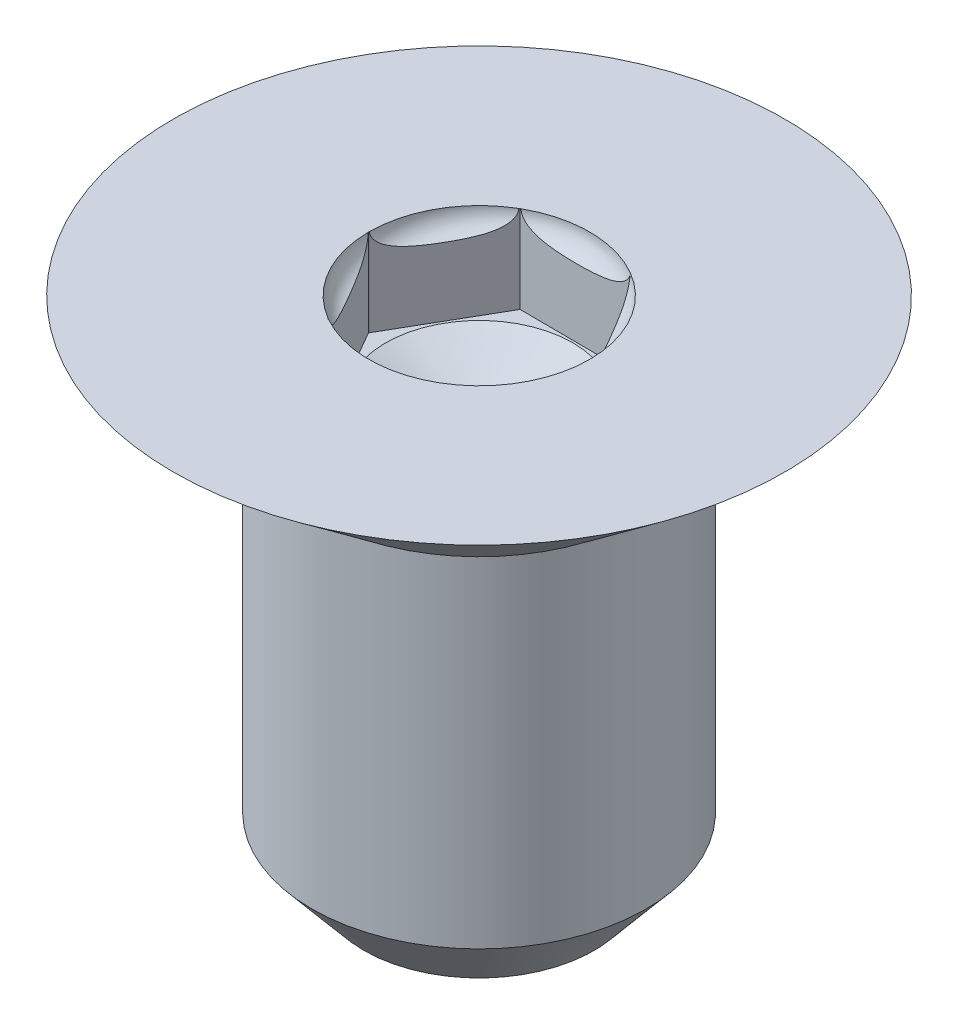
ISO-10303-21;
HEADER;
FILE_DESCRIPTION(('STEP AP214'),'2;1');
FILE_NAME('part.step','',(''),(''),'','','');
FILE_SCHEMA(('AUTOMOTIVE_DESIGN { 1 0 10303 214 1 1 1 1 }'));
ENDSEC;
DATA;
#1=APPLICATION_CONTEXT('core data for automotive mechanical design processes');
#2=APPLICATION_PROTOCOL_DEFINITION('international standard','automotive_design',2000,#1);
#3=PRODUCT_CONTEXT('',#1,'mechanical');
#4=PRODUCT('Part','Part','',(#3));
#5=PRODUCT_RELATED_PRODUCT_CATEGORY('part','',(#4));
#6=PRODUCT_DEFINITION_FORMATION('','',#4);
#7=PRODUCT_DEFINITION_CONTEXT('part definition',#1,'design');
#8=PRODUCT_DEFINITION('design','',#6,#7);
#9=PRODUCT_DEFINITION_SHAPE('','',#8);
#10=(LENGTH_UNIT() NAMED_UNIT(*) SI_UNIT(.MILLI.,.METRE.));
#11=(NAMED_UNIT(*) PLANE_ANGLE_UNIT() SI_UNIT($,.RADIAN.));
#12=(NAMED_UNIT(*) SI_UNIT($,.STERADIAN.) SOLID_ANGLE_UNIT());
#13=UNCERTAINTY_MEASURE_WITH_UNIT(LENGTH_MEASURE(1.E-05),#10,'distance_accuracy_value','');
#14=(GEOMETRIC_REPRESENTATION_CONTEXT(3) GLOBAL_UNCERTAINTY_ASSIGNED_CONTEXT((#13)) GLOBAL_UNIT_ASSIGNED_CONTEXT((#10,
#11,#12)) REPRESENTATION_CONTEXT('',''));
#15=CARTESIAN_POINT('',(0.,0.,0.));
#16=DIRECTION('',(0.,0.,1.));
#17=DIRECTION('',(1.,0.,0.));
#18=AXIS2_PLACEMENT_3D('',#15,#16,#17);
#19=CARTESIAN_POINT('',(-7.85165602355629,18.8976167193551,-0.00419462145266587));
#20=DIRECTION('',(0.,-1.,0.));
#21=DIRECTION('',(0.,0.,-1.));
#22=AXIS2_PLACEMENT_3D('',#19,#20,#21);
#23=PLANE('',#22);
#24=CARTESIAN_POINT('',(-9.23016287600338,18.8976167193551,0.));
#25=DIRECTION('',(0.,-1.,0.));
#26=DIRECTION('',(0.,0.,-1.));
#27=AXIS2_PLACEMENT_3D('',#24,#25,#26);
#28=CIRCLE('',#27,1.16684271429529);
#29=CARTESIAN_POINT('',(-9.23016287600338,18.8976167193551,-1.16684271429529));
#30=VERTEX_POINT('',#29);
#31=EDGE_CURVE('E153',#30,#30,#28,.T.);
#32=ORIENTED_EDGE('',*,*,#31,.T.);
#33=EDGE_LOOP('',(#32));
#34=FACE_BOUND('',#33,.T.);
#35=DIRECTION('',(0.5,0.,-0.866025403784439));
#36=VECTOR('',#35,1.);
#37=CARTESIAN_POINT('',(-7.85165602355629,18.8976167193551,-0.00419462145266571));
#38=LINE('',#37,#36);
#39=CARTESIAN_POINT('',(-8.5409052544111,18.8976167193551,1.18962006546564));
#40=VERTEX_POINT('',#39);
#41=CARTESIAN_POINT('',(-7.85407778938113,18.8976167193551,0.));
#42=VERTEX_POINT('',#41);
#43=EDGE_CURVE('E228',#40,#42,#38,.T.);
#44=ORIENTED_EDGE('',*,*,#43,.T.);
#45=DIRECTION('',(0.5,0.,0.866025403784439));
#46=VECTOR('',#45,1.);
#47=CARTESIAN_POINT('',(-7.85165602355629,18.8976167193551,0.00419462145266571));
#48=LINE('',#47,#46);
#49=CARTESIAN_POINT('',(-8.5409052544111,18.8976167193551,-1.18962006546564));
#50=VERTEX_POINT('',#49);
#51=EDGE_CURVE('E158',#50,#42,#48,.T.);
#52=ORIENTED_EDGE('',*,*,#51,.F.);
#53=DIRECTION('',(0.99998154623352,0.,0.00607512900423805));
#54=VECTOR('',#53,1.);
#55=CARTESIAN_POINT('',(-8.5409052544111,18.8976167193551,-1.18962006546564));
#56=LINE('',#55,#54);
#57=CARTESIAN_POINT('',(-9.91937827763201,18.8976167193551,-1.19799462145267));
#58=VERTEX_POINT('',#57);
#59=EDGE_CURVE('E239',#58,#50,#56,.T.);
#60=ORIENTED_EDGE('',*,*,#59,.F.);
#61=DIRECTION('',(0.5,0.,-0.866025403784439));
#62=VECTOR('',#61,1.);
#63=CARTESIAN_POINT('',(-9.91937827763201,18.8976167193551,-1.19799462145267));
#64=LINE('',#63,#62);
#65=CARTESIAN_POINT('',(-10.6086275084868,18.8976167193551,-0.00417993453436413));
#66=VERTEX_POINT('',#65);
#67=EDGE_CURVE('E146',#66,#58,#64,.T.);
#68=ORIENTED_EDGE('',*,*,#67,.F.);
#69=DIRECTION('',(-0.494729557067822,0.,-0.869046986855991));
#70=VECTOR('',#69,1.);
#71=CARTESIAN_POINT('',(-10.6086275084868,18.8976167193551,-0.00417993453436413));
#72=LINE('',#71,#70);
#73=CARTESIAN_POINT('',(-10.6062479626256,18.8976167193551,0.));
#74=VERTEX_POINT('',#73);
#75=EDGE_CURVE('E142',#74,#66,#72,.T.);
#76=ORIENTED_EDGE('',*,*,#75,.F.);
#77=DIRECTION('',(-0.494729557067822,0.,0.869046986855991));
#78=VECTOR('',#77,1.);
#79=CARTESIAN_POINT('',(-10.6086275084868,18.8976167193551,0.00417993453436413));
#80=LINE('',#79,#78);
#81=CARTESIAN_POINT('',(-10.6086275084868,18.8976167193551,0.00417993453436413));
#82=VERTEX_POINT('',#81);
#83=EDGE_CURVE('E199',#74,#82,#80,.T.);
#84=ORIENTED_EDGE('',*,*,#83,.T.);
#85=DIRECTION('',(0.5,0.,0.866025403784439));
#86=VECTOR('',#85,1.);
#87=CARTESIAN_POINT('',(-9.91937827763201,18.8976167193551,1.19799462145267));
#88=LINE('',#87,#86);
#89=CARTESIAN_POINT('',(-9.91937827763201,18.8976167193551,1.19799462145267));
#90=VERTEX_POINT('',#89);
#91=EDGE_CURVE('E485',#82,#90,#88,.T.);
#92=ORIENTED_EDGE('',*,*,#91,.T.);
#93=DIRECTION('',(0.99998154623352,0.,-0.00607512900423805));
#94=VECTOR('',#93,1.);
#95=CARTESIAN_POINT('',(-8.5409052544111,18.8976167193551,1.18962006546564));
#96=LINE('',#95,#94);
#97=EDGE_CURVE('E233',#90,#40,#96,.T.);
#98=ORIENTED_EDGE('',*,*,#97,.T.);
#99=EDGE_LOOP('',(#44,#52,#60,#68,#76,#84,#92,#98));
#100=FACE_BOUND('',#99,.T.);
#101=ADVANCED_FACE('F33',(#34,#100),#23,.F.);
#102=CARTESIAN_POINT('',(-9.23255929209828,13.6398167193551,0.));
#103=DIRECTION('',(0.,1.,0.));
#104=DIRECTION('',(0.,0.,1.));
#105=AXIS2_PLACEMENT_3D('',#102,#103,#104);
#106=PLANE('',#105);
#107=CARTESIAN_POINT('',(-9.23255929209828,13.6398167193551,0.));
#108=DIRECTION('',(0.,1.,0.));
#109=DIRECTION('',(0.,0.,1.));
#110=AXIS2_PLACEMENT_3D('',#107,#108,#109);
#111=CIRCLE('',#110,1.43526892958908);
#112=CARTESIAN_POINT('',(-9.23255929209828,13.6398167193551,1.43526892958908));
#113=VERTEX_POINT('',#112);
#114=EDGE_CURVE('E11',#113,#113,#111,.T.);
#115=ORIENTED_EDGE('',*,*,#114,.F.);
#116=EDGE_LOOP('',(#115));
#117=FACE_BOUND('',#116,.T.);
#118=ADVANCED_FACE('F35',(#117),#106,.F.);
#119=CARTESIAN_POINT('',(-9.23255929209828,13.6398167193551,0.));
#120=DIRECTION('',(0.,1.,0.));
#121=DIRECTION('',(0.,0.,1.));
#122=AXIS2_PLACEMENT_3D('',#119,#120,#121);
#123=CONICAL_SURFACE('',#122,1.43526892958908,0.698131700797733);
#124=CARTESIAN_POINT('',(-9.23255929209828,14.4115141988337,0.));
#125=DIRECTION('',(0.,1.,0.));
#126=DIRECTION('',(0.,0.,1.));
#127=AXIS2_PLACEMENT_3D('',#124,#125,#126);
#128=CIRCLE('',#127,2.0828);
#129=CARTESIAN_POINT('',(-9.23255929209828,14.4115141988337,2.0828));
#130=VERTEX_POINT('',#129);
#131=EDGE_CURVE('E41',#130,#130,#128,.T.);
#132=ORIENTED_EDGE('',*,*,#131,.F.);
#133=EDGE_LOOP('',(#132));
#134=FACE_BOUND('',#133,.T.);
#135=ORIENTED_EDGE('',*,*,#114,.T.);
#136=EDGE_LOOP('',(#135));
#137=FACE_BOUND('',#136,.T.);
#138=ADVANCED_FACE('F220',(#134,#137),#123,.T.);
#139=CARTESIAN_POINT('',(-9.23255929209828,19.9898167193551,0.));
#140=DIRECTION('',(0.,1.,0.));
#141=DIRECTION('',(0.,0.,1.));
#142=AXIS2_PLACEMENT_3D('',#139,#140,#141);
#143=CYLINDRICAL_SURFACE('',#142,2.0828);
#144=CARTESIAN_POINT('',(-9.23255929209828,18.6436167193551,0.));
#145=DIRECTION('',(0.,1.,0.));
#146=DIRECTION('',(0.,0.,1.));
#147=AXIS2_PLACEMENT_3D('',#144,#145,#146);
#148=CIRCLE('',#147,2.0828);
#149=CARTESIAN_POINT('',(-9.23255929209828,18.6436167193551,2.0828));
#150=VERTEX_POINT('',#149);
#151=EDGE_CURVE('E282',#150,#150,#148,.T.);
#152=ORIENTED_EDGE('',*,*,#151,.F.);
#153=EDGE_LOOP('',(#152));
#154=FACE_BOUND('',#153,.T.);
#155=ORIENTED_EDGE('',*,*,#131,.T.);
#156=EDGE_LOOP('',(#155));
#157=FACE_BOUND('',#156,.T.);
#158=ADVANCED_FACE('F287',(#154,#157),#143,.T.);
#159=CARTESIAN_POINT('',(-9.23255929209828,18.6436167193551,0.));
#160=DIRECTION('',(0.,1.,0.));
#161=DIRECTION('',(0.,0.,1.));
#162=AXIS2_PLACEMENT_3D('',#159,#160,#161);
#163=CONICAL_SURFACE('',#162,2.0828,0.908735864297173);
#164=CARTESIAN_POINT('',(-9.23255929209828,19.9898167193551,0.));
#165=DIRECTION('',(0.,1.,0.));
#166=DIRECTION('',(0.,0.,1.));
#167=AXIS2_PLACEMENT_3D('',#164,#165,#166);
#168=CIRCLE('',#167,3.81);
#169=CARTESIAN_POINT('',(-9.23255929209828,19.9898167193551,3.81));
#170=VERTEX_POINT('',#169);
#171=EDGE_CURVE('E275',#170,#170,#168,.T.);
#172=ORIENTED_EDGE('',*,*,#171,.F.);
#173=EDGE_LOOP('',(#172));
#174=FACE_BOUND('',#173,.T.);
#175=ORIENTED_EDGE('',*,*,#151,.T.);
#176=EDGE_LOOP('',(#175));
#177=FACE_BOUND('',#176,.T.);
#178=ADVANCED_FACE('F295',(#174,#177),#163,.T.);
#179=CARTESIAN_POINT('',(-9.23255929209828,19.9898167193551,0.));
#180=DIRECTION('',(0.,-1.,0.));
#181=DIRECTION('',(0.,0.,-1.));
#182=AXIS2_PLACEMENT_3D('',#179,#180,#181);
#183=PLANE('',#182);
#184=ORIENTED_EDGE('',*,*,#171,.T.);
#185=EDGE_LOOP('',(#184));
#186=FACE_BOUND('',#185,.T.);
#187=CARTESIAN_POINT('',(-9.23016287600338,19.9898167193551,0.));
#188=DIRECTION('',(0.,1.,0.));
#189=DIRECTION('',(0.,0.,1.));
#190=AXIS2_PLACEMENT_3D('',#187,#188,#189);
#191=CIRCLE('',#190,1.37608508662225);
#192=CARTESIAN_POINT('',(-7.85407778938113,19.9898167193551,0.));
#193=VERTEX_POINT('',#192);
#194=CARTESIAN_POINT('',(-9.9073585705198,19.9898167193551,-1.19792159883382));
#195=VERTEX_POINT('',#194);
#196=EDGE_CURVE('E131',#193,#195,#191,.T.);
#197=ORIENTED_EDGE('',*,*,#196,.F.);
#198=CARTESIAN_POINT('',(-9.23016287600338,19.9898167193551,0.));
#199=DIRECTION('',(0.,-1.,0.));
#200=DIRECTION('',(0.,0.,-1.));
#201=AXIS2_PLACEMENT_3D('',#198,#199,#200);
#202=CIRCLE('',#201,1.37608508662225);
#203=CARTESIAN_POINT('',(-9.9073585705198,19.9898167193551,1.19792159883382));
#204=VERTEX_POINT('',#203);
#205=EDGE_CURVE('E164',#193,#204,#202,.T.);
#206=ORIENTED_EDGE('',*,*,#205,.T.);
#207=DIRECTION('',(0.99998154623352,0.,-0.00607512900423805));
#208=VECTOR('',#207,1.);
#209=CARTESIAN_POINT('',(-8.5409052544111,19.9898167193551,1.18962006546564));
#210=LINE('',#209,#208);
#211=CARTESIAN_POINT('',(-9.91937827763201,19.9898167193551,1.19799462145267));
#212=VERTEX_POINT('',#211);
#213=EDGE_CURVE('E271',#212,#204,#210,.T.);
#214=ORIENTED_EDGE('',*,*,#213,.F.);
#215=DIRECTION('',(0.5,0.,0.866025403784439));
#216=VECTOR('',#215,1.);
#217=CARTESIAN_POINT('',(-9.91937827763201,19.9898167193551,1.19799462145267));
#218=LINE('',#217,#216);
#219=CARTESIAN_POINT('',(-9.9254199727138,19.9898167193551,1.18753009860717));
#220=VERTEX_POINT('',#219);
#221=EDGE_CURVE('E266',#220,#212,#218,.T.);
#222=ORIENTED_EDGE('',*,*,#221,.F.);
#223=CARTESIAN_POINT('',(-10.606222657511,19.9898167193551,0.00834525860905571));
#224=VERTEX_POINT('',#223);
#225=EDGE_CURVE('E55',#220,#224,#202,.T.);
#226=ORIENTED_EDGE('',*,*,#225,.T.);
#227=CARTESIAN_POINT('',(-10.6086275084868,19.9898167193551,0.00417993453436413));
#228=VERTEX_POINT('',#227);
#229=EDGE_CURVE('E265',#228,#224,#218,.T.);
#230=ORIENTED_EDGE('',*,*,#229,.F.);
#231=DIRECTION('',(-0.494729557067822,0.,0.869046986855991));
#232=VECTOR('',#231,1.);
#233=CARTESIAN_POINT('',(-10.6086275084868,19.9898167193551,0.00417993453436413));
#234=LINE('',#233,#232);
#235=CARTESIAN_POINT('',(-10.6062479626256,19.9898167193551,0.));
#236=VERTEX_POINT('',#235);
#237=EDGE_CURVE('E198',#236,#228,#234,.T.);
#238=ORIENTED_EDGE('',*,*,#237,.F.);
#239=DIRECTION('',(-0.494729557067822,0.,-0.869046986855991));
#240=VECTOR('',#239,1.);
#241=CARTESIAN_POINT('',(-10.6086275084868,19.9898167193551,-0.00417993453436413));
#242=LINE('',#241,#240);
#243=CARTESIAN_POINT('',(-10.6086275084868,19.9898167193551,-0.00417993453436413));
#244=VERTEX_POINT('',#243);
#245=EDGE_CURVE('E243',#236,#244,#242,.T.);
#246=ORIENTED_EDGE('',*,*,#245,.T.);
#247=DIRECTION('',(0.5,0.,-0.866025403784439));
#248=VECTOR('',#247,1.);
#249=CARTESIAN_POINT('',(-9.91937827763201,19.9898167193551,-1.19799462145267));
#250=LINE('',#249,#248);
#251=CARTESIAN_POINT('',(-10.606222657511,19.9898167193551,-0.00834525860905571));
#252=VERTEX_POINT('',#251);
#253=EDGE_CURVE('E143',#244,#252,#250,.T.);
#254=ORIENTED_EDGE('',*,*,#253,.T.);
#255=CARTESIAN_POINT('',(-9.9254199727138,19.9898167193551,-1.18753009860717));
#256=VERTEX_POINT('',#255);
#257=EDGE_CURVE('E136',#256,#252,#191,.T.);
#258=ORIENTED_EDGE('',*,*,#257,.F.);
#259=CARTESIAN_POINT('',(-9.91937827763201,19.9898167193551,-1.19799462145267));
#260=VERTEX_POINT('',#259);
#261=EDGE_CURVE('E141',#256,#260,#250,.T.);
#262=ORIENTED_EDGE('',*,*,#261,.T.);
#263=DIRECTION('',(0.99998154623352,0.,0.00607512900423805));
#264=VECTOR('',#263,1.);
#265=CARTESIAN_POINT('',(-8.5409052544111,19.9898167193551,-1.18962006546564));
#266=LINE('',#265,#264);
#267=EDGE_CURVE('E120',#260,#195,#266,.T.);
#268=ORIENTED_EDGE('',*,*,#267,.T.);
#269=EDGE_LOOP('',(#197,#206,#214,#222,#226,#230,#238,#246,#254,#258,#262,#268));
#270=FACE_BOUND('',#269,.T.);
#271=ADVANCED_FACE('F138',(#186,#270),#183,.F.);
#272=CARTESIAN_POINT('',(-7.85165602355629,18.8976167193551,-0.00419462145266571));
#273=DIRECTION('',(0.866025403784438,0.,0.5));
#274=DIRECTION('',(0.5,0.,-0.866025403784439));
#275=AXIS2_PLACEMENT_3D('',#272,#273,#274);
#276=PLANE('',#275);
#277=DIRECTION('',(0.,1.,0.));
#278=VECTOR('',#277,1.);
#279=CARTESIAN_POINT('',(-8.5409052544111,18.8976167193551,1.18962006546564));
#280=LINE('',#279,#278);
#281=CARTESIAN_POINT('',(-8.5409052544111,19.9651031763011,1.18962006546564));
#282=VERTEX_POINT('',#281);
#283=EDGE_CURVE('E273',#40,#282,#280,.T.);
#284=ORIENTED_EDGE('',*,*,#283,.T.);
#285=CARTESIAN_POINT('',(-8.5410207244577,19.9663025861777,1.18982006545309));
#286=CARTESIAN_POINT('',(-8.54025177906701,19.9580429965198,1.18848821296818));
#287=CARTESIAN_POINT('',(-8.53907551636561,19.9499769480888,1.18645086620631));
#288=CARTESIAN_POINT('',(-8.53605732607646,19.934459414302,1.18122320727859));
#289=CARTESIAN_POINT('',(-8.53422315416802,19.9270019623432,1.17804632834335));
#290=CARTESIAN_POINT('',(-8.52938857291304,19.9106122948396,1.1696725879764));
#291=CARTESIAN_POINT('',(-8.52620354751648,19.901901213803,1.16415596216617));
#292=CARTESIAN_POINT('',(-8.519174705691,19.8855705682567,1.15198165100607));
#293=CARTESIAN_POINT('',(-8.51532746086103,19.8779570832735,1.14531802749142));
#294=CARTESIAN_POINT('',(-8.50472054869631,19.8594962681546,1.12694631671069));
#295=CARTESIAN_POINT('',(-8.49760537352573,19.849473419069,1.1146224718105));
#296=CARTESIAN_POINT('',(-8.48273224504307,19.831634460041,1.08886145761103));
#297=CARTESIAN_POINT('',(-8.47497337057645,19.8238215856283,1.07542269282529));
#298=CARTESIAN_POINT('',(-8.457266238631,19.8083492675329,1.04475304063945));
#299=CARTESIAN_POINT('',(-8.44722287111661,19.8011329633905,1.02735741782544));
#300=CARTESIAN_POINT('',(-8.4268296661546,19.7886645498011,0.992035350702078));
#301=CARTESIAN_POINT('',(-8.41647929647189,19.7834160961446,0.974107984534499));
#302=CARTESIAN_POINT('',(-8.38510931879488,19.7698378067559,0.919773589365605));
#303=CARTESIAN_POINT('',(-8.36385570266879,19.7637376045021,0.882961246390659));
#304=CARTESIAN_POINT('',(-8.31627578485758,19.7537823203676,0.800550411321701));
#305=CARTESIAN_POINT('',(-8.28991551937891,19.7507753243574,0.754893092211631));
#306=CARTESIAN_POINT('',(-8.23724596920591,19.7471905365173,0.663666755300194));
#307=CARTESIAN_POINT('',(-8.21093678818061,19.7466050663139,0.618097917058853));
#308=CARTESIAN_POINT('',(-8.16635613843248,19.7471858816889,0.540881966660656));
#309=CARTESIAN_POINT('',(-8.14808264029577,19.7478719866129,0.509231339455851));
#310=CARTESIAN_POINT('',(-8.11152226671932,19.7504872497638,0.44590691487775));
#311=CARTESIAN_POINT('',(-8.09323542146414,19.7524185221368,0.414233169785631));
#312=CARTESIAN_POINT('',(-8.05596834900121,19.7584046190258,0.349684706830488));
#313=CARTESIAN_POINT('',(-8.03699139056545,19.7625455339918,0.31681565064663));
#314=CARTESIAN_POINT('',(-7.99932372607394,19.7744480906428,0.251573341944869));
#315=CARTESIAN_POINT('',(-7.98063239054361,19.7822000262935,0.21919899914502));
#316=CARTESIAN_POINT('',(-7.95374115388087,19.7980706699895,0.172622010966805));
#317=CARTESIAN_POINT('',(-7.94520181106526,19.8038446182082,0.157831435346913));
#318=CARTESIAN_POINT('',(-7.92845360434563,19.8171504576855,0.128822690372847));
#319=CARTESIAN_POINT('',(-7.92024492899465,19.8246833357374,0.114604847602113));
#320=CARTESIAN_POINT('',(-7.90581571820559,19.8404626741972,0.0896127214023341));
#321=CARTESIAN_POINT('',(-7.89949903752134,19.8483520967887,0.0786719095220373));
#322=CARTESIAN_POINT('',(-7.88753768761909,19.8659677646776,0.0579542437642165));
#323=CARTESIAN_POINT('',(-7.88189120031952,19.8756888464519,0.0481742408770708));
#324=CARTESIAN_POINT('',(-7.87368220191832,19.8930392522053,0.0339558385669417));
#325=CARTESIAN_POINT('',(-7.87077432195684,19.9000118273172,0.0289192427313438));
#326=CARTESIAN_POINT('',(-7.8655134123164,19.9147571918062,0.0198070799400806));
#327=CARTESIAN_POINT('',(-7.86315981657212,19.9225291530463,0.0157305325304987));
#328=CARTESIAN_POINT('',(-7.85949988363075,19.9374627967619,0.00939134272376775));
#329=CARTESIAN_POINT('',(-7.85808539929409,19.944517621458,0.00694138398615286));
#330=CARTESIAN_POINT('',(-7.85586425827772,19.9589927318683,0.00309425489502958));
#331=CARTESIAN_POINT('',(-7.85505625851311,19.9664121710422,0.00169475825021888));
#332=CARTESIAN_POINT('',(-7.85424075204131,19.9792526672285,0.000282259607159903));
#333=CARTESIAN_POINT('',(-7.85406974661107,19.9846340269309,-1.39304863843573E-05));
#334=CARTESIAN_POINT('',(-7.85407786866262,19.9900167193551,1.37319558392975E-07));
#335=B_SPLINE_CURVE_WITH_KNOTS('',3,(#285,#286,#287,#288,#289,#290,#291,#292,#293,#294,#295,
#296,#297,#298,#299,#300,#301,#302,#303,#304,#305,#306,#307,#308,#309,#310,#311,#312,#313,#314,
#315,#316,#317,#318,#319,#320,#321,#322,#323,#324,#325,#326,#327,#328,#329,#330,#331,#332,#333,
#334),.UNSPECIFIED.,.F.,.F.,(4,2,2,2,2,2,2,2,2,2,2,2,2,2,2,2,2,2,2,2,2,2,2,2,4),(0.,
0.0251032977296163,0.0499199019394481,0.0821181520299741,0.114488406734093,0.166411393836404,
0.21841001029617,0.282292444973923,0.346292976561169,0.474830801121536,0.633161046589517,
0.790988858763883,0.900638611970863,1.01047502942993,1.12494182880065,1.23910271355044,
1.29312042594905,1.3471685164407,1.3917345545942,1.43617678960089,1.46333555430004,
1.49046646152868,1.5131772888594,1.53583767253141,1.55197352528732),.UNSPECIFIED.);
#336=EDGE_CURVE('E48',#282,#193,#335,.T.);
#337=ORIENTED_EDGE('',*,*,#336,.T.);
#338=DIRECTION('',(0.,-1.,0.));
#339=VECTOR('',#338,1.);
#340=CARTESIAN_POINT('',(-7.85407778938113,18.8976167193551,0.));
#341=LINE('',#340,#339);
#342=EDGE_CURVE('E238',#193,#42,#341,.T.);
#343=ORIENTED_EDGE('',*,*,#342,.T.);
#344=ORIENTED_EDGE('',*,*,#43,.F.);
#345=EDGE_LOOP('',(#284,#337,#343,#344));
#346=FACE_BOUND('',#345,.T.);
#347=ADVANCED_FACE('F201',(#346),#276,.F.);
#348=CARTESIAN_POINT('',(-8.5409052544111,18.8976167193551,1.18962006546564));
#349=DIRECTION('',(0.00607512900423805,0.,0.99998154623352));
#350=DIRECTION('',(0.99998154623352,0.,-0.00607512900423805));
#351=AXIS2_PLACEMENT_3D('',#348,#349,#350);
#352=PLANE('',#351);
#353=ORIENTED_EDGE('',*,*,#213,.T.);
#354=CARTESIAN_POINT('',(-9.90672246738633,20.0024451996549,1.19791773435391));
#355=CARTESIAN_POINT('',(-9.90746734221934,19.9952349540357,1.19792225964812));
#356=CARTESIAN_POINT('',(-9.90755802547569,19.9879679988203,1.19792281057077));
#357=CARTESIAN_POINT('',(-9.90650667706948,19.9735733628576,1.19791642337571));
#358=CARTESIAN_POINT('',(-9.90537325775987,19.9664450636427,1.19790953758012));
#359=CARTESIAN_POINT('',(-9.90195974565438,19.952482284736,1.19788879967103));
#360=CARTESIAN_POINT('',(-9.89968101225531,19.9456474671195,1.19787495581619));
#361=CARTESIAN_POINT('',(-9.89413622326628,19.9323856575184,1.19784126988615));
#362=CARTESIAN_POINT('',(-9.89086852010914,19.9259593679038,1.19782141780157));
#363=CARTESIAN_POINT('',(-9.88170957124894,19.9105495232937,1.19776577497889));
#364=CARTESIAN_POINT('',(-9.87531852279774,19.9018632836556,1.19772694781857));
#365=CARTESIAN_POINT('',(-9.86124600987338,19.8856108896363,1.19764145390945));
#366=CARTESIAN_POINT('',(-9.85356142051763,19.8780475331965,1.19759476817624));
#367=CARTESIAN_POINT('',(-9.83231297680406,19.8596425385939,1.19746567875736));
#368=CARTESIAN_POINT('',(-9.81803320786765,19.8496341406348,1.197378925718));
#369=CARTESIAN_POINT('',(-9.7881826277447,19.8318216412822,1.19719757624632));
#370=CARTESIAN_POINT('',(-9.77260908828556,19.8240223592825,1.19710296323909));
#371=CARTESIAN_POINT('',(-9.73696643743201,19.8085346641728,1.19688642554116));
#372=CARTESIAN_POINT('',(-9.71670180081298,19.8013042034566,1.19676331298759));
#373=CARTESIAN_POINT('',(-9.67555904460863,19.788824190954,1.1965133608235));
#374=CARTESIAN_POINT('',(-9.65467984996645,19.7835783639238,1.19638651468175));
#375=CARTESIAN_POINT('',(-9.59140831351773,19.7700210914312,1.19600212484209));
#376=CARTESIAN_POINT('',(-9.54855030855699,19.7639514198607,1.19574175212823));
#377=CARTESIAN_POINT('',(-9.45290000543205,19.7541012179433,1.19516065347399));
#378=CARTESIAN_POINT('',(-9.40004313822718,19.7511435369202,1.19483953526112));
#379=CARTESIAN_POINT('',(-9.29443848768289,19.7476682305403,1.19419796154617));
#380=CARTESIAN_POINT('',(-9.24169091625226,19.7471426229511,1.19387750733148));
#381=CARTESIAN_POINT('',(-9.15284360584022,19.747892714471,1.19333773849828));
#382=CARTESIAN_POINT('',(-9.11673859806908,19.7486527196007,1.1931183918706));
#383=CARTESIAN_POINT('',(-9.04449567060771,19.7514447536728,1.19267949866739));
#384=CARTESIAN_POINT('',(-9.00835783112661,19.7534793418931,1.19245995257916));
#385=CARTESIAN_POINT('',(-8.93434149349705,19.7597354073217,1.19201028548159));
#386=CARTESIAN_POINT('',(-8.8964717847758,19.764066632339,1.19178021787014));
#387=CARTESIAN_POINT('',(-8.82137867419681,19.7764488467533,1.19132400911727));
#388=CARTESIAN_POINT('',(-8.78415340411051,19.7844860615314,1.19109785662592));
#389=CARTESIAN_POINT('',(-8.73146159690915,19.8006542427065,1.19077774119237));
#390=CARTESIAN_POINT('',(-8.71525243550078,19.8063191670941,1.19067926662853));
#391=CARTESIAN_POINT('',(-8.68342927252983,19.8192939714991,1.19048593324043));
#392=CARTESIAN_POINT('',(-8.66781718514458,19.8266086953907,1.19039108604525));
#393=CARTESIAN_POINT('',(-8.63745629641259,19.8434300666635,1.19020663632573));
#394=CARTESIAN_POINT('',(-8.62272595032449,19.8529708336426,1.19011714592153));
#395=CARTESIAN_POINT('',(-8.59536932125371,19.8746919522588,1.18995094780383));
#396=CARTESIAN_POINT('',(-8.58272942317835,19.8868539301452,1.18987415737534));
#397=CARTESIAN_POINT('',(-8.56683720545632,19.9069505523659,1.18977760832083));
#398=CARTESIAN_POINT('',(-8.56214408747073,19.9137440407478,1.18974909649748));
#399=CARTESIAN_POINT('',(-8.55383554571265,19.9279728382398,1.18969862010298));
#400=CARTESIAN_POINT('',(-8.55022000357575,19.9354080767421,1.18967665481274));
#401=CARTESIAN_POINT('',(-8.54430108008839,19.9508812788562,1.18964069592541));
#402=CARTESIAN_POINT('',(-8.54201158826549,19.9589246587162,1.18962678671056));
#403=CARTESIAN_POINT('',(-8.53903574920585,19.9752924887217,1.18960870777075));
#404=CARTESIAN_POINT('',(-8.53834521149014,19.98361614604,1.18960451258763));
#405=CARTESIAN_POINT('',(-8.53853705526088,19.9954344114608,1.18960567808479));
#406=CARTESIAN_POINT('',(-8.53874247846486,19.9989485906903,1.18960692608028));
#407=CARTESIAN_POINT('',(-8.53909848349986,20.0024451996546,1.18960908889671));
#408=B_SPLINE_CURVE_WITH_KNOTS('',3,(#354,#355,#356,#357,#358,#359,#360,#361,#362,#363,#364,
#365,#366,#367,#368,#369,#370,#371,#372,#373,#374,#375,#376,#377,#378,#379,#380,#381,#382,#383,
#384,#385,#386,#387,#388,#389,#390,#391,#392,#393,#394,#395,#396,#397,#398,#399,#400,#401,#402,
#403,#404,#405,#406,#407),.UNSPECIFIED.,.F.,.F.,(4,2,2,2,2,2,2,2,2,2,2,2,2,2,2,2,2,2,2,2,2,2,2,
2,2,2,4),(0.,0.0217019483507693,0.0432521982063049,0.0647769298188441,0.0863377196584186,
0.118505940378392,0.150753017326113,0.20277159729281,0.254902801658449,0.319301156640255,
0.383819781714814,0.513388824914641,0.672124203293093,0.830338229959943,0.938667936156022,
1.04721586146767,1.1614924849488,1.27534774100223,1.32679678254437,1.37839889358382,
1.43085096588665,1.48294667832307,1.50764122571255,1.5323330595727,1.55727905368927,
1.58215959592057,1.59270700422709),.UNSPECIFIED.);
#409=EDGE_CURVE('E173',#204,#282,#408,.T.);
#410=ORIENTED_EDGE('',*,*,#409,.T.);
#411=ORIENTED_EDGE('',*,*,#283,.F.);
#412=ORIENTED_EDGE('',*,*,#97,.F.);
#413=DIRECTION('',(0.,1.,0.));
#414=VECTOR('',#413,1.);
#415=CARTESIAN_POINT('',(-9.91937827763201,18.8976167193551,1.19799462145267));
#416=LINE('',#415,#414);
#417=EDGE_CURVE('E276',#90,#212,#416,.T.);
#418=ORIENTED_EDGE('',*,*,#417,.T.);
#419=EDGE_LOOP('',(#353,#410,#411,#412,#418));
#420=FACE_BOUND('',#419,.T.);
#421=ADVANCED_FACE('F204',(#420),#352,.F.);
#422=CARTESIAN_POINT('',(-9.91937827763201,18.8976167193551,1.19799462145267));
#423=DIRECTION('',(-0.866025403784438,0.,0.5));
#424=DIRECTION('',(0.5,0.,0.866025403784439));
#425=AXIS2_PLACEMENT_3D('',#422,#423,#424);
#426=PLANE('',#425);
#427=ORIENTED_EDGE('',*,*,#229,.T.);
#428=CARTESIAN_POINT('',(-10.6062225773863,19.9900167193551,0.00834539738912102));
#429=CARTESIAN_POINT('',(-10.6062370057453,19.9825691910884,0.00832040673837271));
#430=CARTESIAN_POINT('',(-10.6059017223897,19.9751382085884,0.00890113454518866));
#431=CARTESIAN_POINT('',(-10.6046044710317,19.9605592339623,0.0111480398074086));
#432=CARTESIAN_POINT('',(-10.6036477305634,19.9534094041909,0.0128051629081569));
#433=CARTESIAN_POINT('',(-10.6011815283797,19.9395310040401,0.0170767503919679));
#434=CARTESIAN_POINT('',(-10.5996735287218,19.932801373977,0.0196886824173666));
#435=CARTESIAN_POINT('',(-10.596198100755,19.9198246642816,0.025708300233959));
#436=CARTESIAN_POINT('',(-10.5942296663447,19.9135786818373,0.0291177286437987));
#437=CARTESIAN_POINT('',(-10.5885826045729,19.8978862749839,0.0388987265461477));
#438=CARTESIAN_POINT('',(-10.5846030290512,19.8888732778448,0.0457915535421699));
#439=CARTESIAN_POINT('',(-10.5759943300273,19.8721950626184,0.0607022576386423));
#440=CARTESIAN_POINT('',(-10.5713635756004,19.8645333409813,0.0687229595834152));
#441=CARTESIAN_POINT('',(-10.5582724381686,19.8454411766822,0.0913974747441788));
#442=CARTESIAN_POINT('',(-10.5494047159341,19.8351382178497,0.106756820201725));
#443=CARTESIAN_POINT('',(-10.5310381373097,19.8171679853187,0.138568667540472));
#444=CARTESIAN_POINT('',(-10.5215377894616,19.8095072236159,0.155023752702958));
#445=CARTESIAN_POINT('',(-10.4980106831586,19.7932857809624,0.195773896174741));
#446=CARTESIAN_POINT('',(-10.4838067471281,19.785774140051,0.220375835047118));
#447=CARTESIAN_POINT('',(-10.4550967393563,19.7734914224836,0.270103027193526));
#448=CARTESIAN_POINT('',(-10.4405900167611,19.7687270561529,0.295229407779673));
#449=CARTESIAN_POINT('',(-10.4113953452759,19.7610527284705,0.34579606210236));
#450=CARTESIAN_POINT('',(-10.3967068809104,19.7581509810603,0.371237228668531));
#451=CARTESIAN_POINT('',(-10.367279051483,19.7536226072168,0.42220772439332));
#452=CARTESIAN_POINT('',(-10.3525396677321,19.751996513593,0.447737085922161));
#453=CARTESIAN_POINT('',(-10.3153105765262,19.748984456332,0.512219763410473));
#454=CARTESIAN_POINT('',(-10.2928100582988,19.7481716347412,0.551191804176913));
#455=CARTESIAN_POINT('',(-10.247797058238,19.7479704704461,0.629156607283302));
#456=CARTESIAN_POINT('',(-10.2252845759143,19.7485828215974,0.668149370472403));
#457=CARTESIAN_POINT('',(-10.1872481073212,19.7512085227621,0.734030466616226));
#458=CARTESIAN_POINT('',(-10.1717162462374,19.752729968281,0.760932439149466));
#459=CARTESIAN_POINT('',(-10.140701555142,19.7571083410408,0.814651459907736));
#460=CARTESIAN_POINT('',(-10.1252187065286,19.7599646790488,0.841468540351981));
#461=CARTESIAN_POINT('',(-10.0923525688706,19.7681933418347,0.898394360624169));
#462=CARTESIAN_POINT('',(-10.074986122966,19.7738463249442,0.928473927277839));
#463=CARTESIAN_POINT('',(-10.0407223556945,19.789221208,0.987820513050853));
#464=CARTESIAN_POINT('',(-10.0238232222318,19.7989239824532,1.01709067081213));
#465=CARTESIAN_POINT('',(-10.0015153607529,19.8167192902002,1.05572902030173));
#466=CARTESIAN_POINT('',(-9.99555183676089,19.8220003148558,1.0660581468481));
#467=CARTESIAN_POINT('',(-9.98388819775135,19.8336731239688,1.08626016221376));
#468=CARTESIAN_POINT('',(-9.97818841595108,19.8400662674686,1.09613247388389));
#469=CARTESIAN_POINT('',(-9.96715337953549,19.8542277684913,1.11524571761907));
#470=CARTESIAN_POINT('',(-9.96182184402395,19.8620079221237,1.1244802080074));
#471=CARTESIAN_POINT('',(-9.951820431885,19.8791313615739,1.1418031619795));
#472=CARTESIAN_POINT('',(-9.94714917781676,19.888471301866,1.14989401136076));
#473=CARTESIAN_POINT('',(-9.94033645702266,19.9051761904318,1.16169398991393));
#474=CARTESIAN_POINT('',(-9.93788982527749,19.9120407462761,1.16593168040397));
#475=CARTESIAN_POINT('',(-9.93355390311176,19.9264234091098,1.17344171789267));
#476=CARTESIAN_POINT('',(-9.93166279125812,19.9339392731938,1.17671721970599));
#477=CARTESIAN_POINT('',(-9.92860815391688,19.9493572996862,1.18200800677971));
#478=CARTESIAN_POINT('',(-9.92742921249358,19.9572469625238,1.184049993224));
#479=CARTESIAN_POINT('',(-9.92582122263771,19.9734181911543,1.18683511335243));
#480=CARTESIAN_POINT('',(-9.92540114384541,19.9817032713796,1.18756271116388));
#481=CARTESIAN_POINT('',(-9.92542005283851,19.9900167193551,1.1875299598271));
#482=B_SPLINE_CURVE_WITH_KNOTS('',3,(#428,#429,#430,#431,#432,#433,#434,#435,#436,#437,#438,
#439,#440,#441,#442,#443,#444,#445,#446,#447,#448,#449,#450,#451,#452,#453,#454,#455,#456,#457,
#458,#459,#460,#461,#462,#463,#464,#465,#466,#467,#468,#469,#470,#471,#472,#473,#474,#475,#476,
#477,#478,#479,#480,#481),.UNSPECIFIED.,.F.,.F.,(4,2,2,2,2,2,2,2,2,2,2,2,2,2,2,2,2,2,2,2,2,2,2,
2,2,2,4),(0.,0.0222833842662029,0.0443817123357982,0.0664218511671759,0.0885106076399317,
0.124375376650943,0.160331626725923,0.221515775860146,0.282849660418464,0.370766735819328,
0.458897652274974,0.547414593580953,0.635968486602804,0.770962302293942,0.906021854448972,
0.999307937795089,1.09255288271159,1.19801722454597,1.30298903853843,1.34207706474702,
1.38121319761735,1.42069960044674,1.4601023732889,1.48531240853987,1.51043883836592,
1.53499982114072,1.55984925743385),.UNSPECIFIED.);
#483=EDGE_CURVE('E166',#224,#220,#482,.T.);
#484=ORIENTED_EDGE('',*,*,#483,.T.);
#485=ORIENTED_EDGE('',*,*,#221,.T.);
#486=ORIENTED_EDGE('',*,*,#417,.F.);
#487=ORIENTED_EDGE('',*,*,#91,.F.);
#488=DIRECTION('',(0.,1.,0.));
#489=VECTOR('',#488,1.);
#490=CARTESIAN_POINT('',(-10.6086275084868,18.8976167193551,0.00417993453436413));
#491=LINE('',#490,#489);
#492=EDGE_CURVE('E235',#82,#228,#491,.T.);
#493=ORIENTED_EDGE('',*,*,#492,.T.);
#494=EDGE_LOOP('',(#427,#484,#485,#486,#487,#493));
#495=FACE_BOUND('',#494,.T.);
#496=ADVANCED_FACE('F179',(#495),#426,.F.);
#497=CARTESIAN_POINT('',(-10.6086275084868,18.8976167193551,0.00417993453436413));
#498=DIRECTION('',(-0.869046986855991,0.,-0.494729557067822));
#499=DIRECTION('',(-0.494729557067822,0.,0.869046986855991));
#500=AXIS2_PLACEMENT_3D('',#497,#498,#499);
#501=PLANE('',#500);
#502=ORIENTED_EDGE('',*,*,#83,.F.);
#503=DIRECTION('',(0.,1.,0.));
#504=VECTOR('',#503,1.);
#505=CARTESIAN_POINT('',(-10.6062479626256,18.8976167193551,0.));
#506=LINE('',#505,#504);
#507=EDGE_CURVE('E247',#74,#236,#506,.T.);
#508=ORIENTED_EDGE('',*,*,#507,.T.);
#509=ORIENTED_EDGE('',*,*,#237,.T.);
#510=ORIENTED_EDGE('',*,*,#492,.F.);
#511=EDGE_LOOP('',(#502,#508,#509,#510));
#512=FACE_BOUND('',#511,.T.);
#513=ADVANCED_FACE('F212',(#512),#501,.F.);
#514=CARTESIAN_POINT('',(-9.23016287600338,18.8976167193551,0.));
#515=DIRECTION('',(0.,1.,0.));
#516=DIRECTION('',(0.,0.,1.));
#517=AXIS2_PLACEMENT_3D('',#514,#515,#516);
#518=CONICAL_SURFACE('',#517,1.16684271429529,1.13865511657009);
#519=CARTESIAN_POINT('',(-9.23016287600338,18.5293167193551,0.));
#520=DIRECTION('',(0.,-1.,0.));
#521=DIRECTION('',(0.,0.,-1.));
#522=AXIS2_PLACEMENT_3D('',#519,#520,#521);
#523=CIRCLE('',#522,0.3683);
#524=CARTESIAN_POINT('',(-9.23016287600338,18.5293167193551,-0.3683));
#525=VERTEX_POINT('',#524);
#526=EDGE_CURVE('E161',#525,#525,#523,.T.);
#527=ORIENTED_EDGE('',*,*,#526,.T.);
#528=EDGE_LOOP('',(#527));
#529=FACE_BOUND('',#528,.T.);
#530=ORIENTED_EDGE('',*,*,#31,.F.);
#531=EDGE_LOOP('',(#530));
#532=FACE_BOUND('',#531,.T.);
#533=ADVANCED_FACE('F305',(#529,#532),#518,.F.);
#534=CARTESIAN_POINT('',(0.,18.5293167193551,0.));
#535=DIRECTION('',(0.,-1.,0.));
#536=DIRECTION('',(0.,0.,-1.));
#537=AXIS2_PLACEMENT_3D('',#534,#535,#536);
#538=PLANE('',#537);
#539=ORIENTED_EDGE('',*,*,#526,.F.);
#540=EDGE_LOOP('',(#539));
#541=FACE_BOUND('',#540,.T.);
#542=ADVANCED_FACE('F189',(#541),#538,.F.);
#543=CARTESIAN_POINT('',(-9.23016287600338,19.9898167193551,0.));
#544=DIRECTION('',(0.,-1.,0.));
#545=DIRECTION('',(0.,0.,-1.));
#546=AXIS2_PLACEMENT_3D('',#543,#544,#545);
#547=TOROIDAL_SURFACE('',#546,1.12381969164447,0.252265394977771);
#548=ORIENTED_EDGE('',*,*,#225,.F.);
#549=ORIENTED_EDGE('',*,*,#483,.F.);
#550=EDGE_LOOP('',(#548,#549));
#551=FACE_BOUND('',#550,.T.);
#552=ADVANCED_FACE('F188',(#551),#547,.F.);
#553=ORIENTED_EDGE('',*,*,#409,.F.);
#554=ORIENTED_EDGE('',*,*,#205,.F.);
#555=ORIENTED_EDGE('',*,*,#336,.F.);
#556=EDGE_LOOP('',(#553,#554,#555));
#557=FACE_BOUND('',#556,.T.);
#558=ADVANCED_FACE('F182',(#557),#547,.F.);
#559=CARTESIAN_POINT('',(-7.85165602355629,18.8976167193551,0.00419462145266571));
#560=DIRECTION('',(0.866025403784438,0.,-0.5));
#561=DIRECTION('',(0.5,0.,0.866025403784439));
#562=AXIS2_PLACEMENT_3D('',#559,#560,#561);
#563=PLANE('',#562);
#564=DIRECTION('',(0.,1.,0.));
#565=VECTOR('',#564,1.);
#566=CARTESIAN_POINT('',(-8.5409052544111,18.8976167193551,-1.18962006546564));
#567=LINE('',#566,#565);
#568=CARTESIAN_POINT('',(-8.5409052544111,19.9651031763011,-1.18962006546564));
#569=VERTEX_POINT('',#568);
#570=EDGE_CURVE('E123',#50,#569,#567,.T.);
#571=ORIENTED_EDGE('',*,*,#570,.F.);
#572=ORIENTED_EDGE('',*,*,#51,.T.);
#573=ORIENTED_EDGE('',*,*,#342,.F.);
#574=CARTESIAN_POINT('',(-8.5410207244577,19.9663025861777,-1.18982006545309));
#575=CARTESIAN_POINT('',(-8.54025177906701,19.9580429965198,-1.18848821296818));
#576=CARTESIAN_POINT('',(-8.53907551636561,19.9499769480888,-1.18645086620631));
#577=CARTESIAN_POINT('',(-8.53605732607646,19.934459414302,-1.18122320727859));
#578=CARTESIAN_POINT('',(-8.53422315416802,19.9270019623432,-1.17804632834335));
#579=CARTESIAN_POINT('',(-8.52938857291304,19.9106122948396,-1.1696725879764));
#580=CARTESIAN_POINT('',(-8.52620354751648,19.901901213803,-1.16415596216617));
#581=CARTESIAN_POINT('',(-8.519174705691,19.8855705682567,-1.15198165100607));
#582=CARTESIAN_POINT('',(-8.51532746086103,19.8779570832735,-1.14531802749142));
#583=CARTESIAN_POINT('',(-8.50472054869631,19.8594962681546,-1.12694631671069));
#584=CARTESIAN_POINT('',(-8.49760537352573,19.849473419069,-1.1146224718105));
#585=CARTESIAN_POINT('',(-8.48273224504307,19.831634460041,-1.08886145761103));
#586=CARTESIAN_POINT('',(-8.47497337057645,19.8238215856283,-1.07542269282529));
#587=CARTESIAN_POINT('',(-8.457266238631,19.8083492675329,-1.04475304063945));
#588=CARTESIAN_POINT('',(-8.44722287111661,19.8011329633905,-1.02735741782544));
#589=CARTESIAN_POINT('',(-8.4268296661546,19.7886645498011,-0.992035350702078));
#590=CARTESIAN_POINT('',(-8.41647929647189,19.7834160961446,-0.974107984534499));
#591=CARTESIAN_POINT('',(-8.38510931879488,19.7698378067559,-0.919773589365605));
#592=CARTESIAN_POINT('',(-8.36385570266879,19.7637376045021,-0.882961246390659));
#593=CARTESIAN_POINT('',(-8.31627578485758,19.7537823203676,-0.800550411321701));
#594=CARTESIAN_POINT('',(-8.28991551937891,19.7507753243574,-0.754893092211631));
#595=CARTESIAN_POINT('',(-8.23724596920591,19.7471905365173,-0.663666755300194));
#596=CARTESIAN_POINT('',(-8.21093678818061,19.7466050663139,-0.618097917058853));
#597=CARTESIAN_POINT('',(-8.16635613843248,19.7471858816889,-0.540881966660656));
#598=CARTESIAN_POINT('',(-8.14808264029577,19.7478719866129,-0.509231339455851));
#599=CARTESIAN_POINT('',(-8.11152226671932,19.7504872497638,-0.44590691487775));
#600=CARTESIAN_POINT('',(-8.09323542146414,19.7524185221368,-0.414233169785631));
#601=CARTESIAN_POINT('',(-8.05596834900121,19.7584046190258,-0.349684706830488));
#602=CARTESIAN_POINT('',(-8.03699139056545,19.7625455339918,-0.31681565064663));
#603=CARTESIAN_POINT('',(-7.99932372607394,19.7744480906428,-0.251573341944869));
#604=CARTESIAN_POINT('',(-7.98063239054361,19.7822000262935,-0.21919899914502));
#605=CARTESIAN_POINT('',(-7.95374115388087,19.7980706699895,-0.172622010966805));
#606=CARTESIAN_POINT('',(-7.94520181106526,19.8038446182082,-0.157831435346913));
#607=CARTESIAN_POINT('',(-7.92845360434563,19.8171504576855,-0.128822690372847));
#608=CARTESIAN_POINT('',(-7.92024492899465,19.8246833357374,-0.114604847602113));
#609=CARTESIAN_POINT('',(-7.90581571820559,19.8404626741972,-0.0896127214023341));
#610=CARTESIAN_POINT('',(-7.89949903752134,19.8483520967887,-0.0786719095220373));
#611=CARTESIAN_POINT('',(-7.88753768761909,19.8659677646776,-0.0579542437642165));
#612=CARTESIAN_POINT('',(-7.88189120031952,19.8756888464519,-0.0481742408770708));
#613=CARTESIAN_POINT('',(-7.87368220191832,19.8930392522053,-0.0339558385669417));
#614=CARTESIAN_POINT('',(-7.87077432195684,19.9000118273172,-0.0289192427313438));
#615=CARTESIAN_POINT('',(-7.8655134123164,19.9147571918062,-0.0198070799400806));
#616=CARTESIAN_POINT('',(-7.86315981657212,19.9225291530463,-0.0157305325304987));
#617=CARTESIAN_POINT('',(-7.85949988363075,19.9374627967619,-0.00939134272376775));
#618=CARTESIAN_POINT('',(-7.85808539929409,19.944517621458,-0.00694138398615286));
#619=CARTESIAN_POINT('',(-7.85586425827772,19.9589927318683,-0.00309425489502958));
#620=CARTESIAN_POINT('',(-7.85505625851311,19.9664121710422,-0.00169475825021888));
#621=CARTESIAN_POINT('',(-7.85424075204131,19.9792526672285,-0.000282259607159903));
#622=CARTESIAN_POINT('',(-7.85406974661107,19.9846340269309,1.39304863843573E-05));
#623=CARTESIAN_POINT('',(-7.85407786866262,19.9900167193551,-1.37319558392975E-07));
#624=B_SPLINE_CURVE_WITH_KNOTS('',3,(#574,#575,#576,#577,#578,#579,#580,#581,#582,#583,#584,
#585,#586,#587,#588,#589,#590,#591,#592,#593,#594,#595,#596,#597,#598,#599,#600,#601,#602,#603,
#604,#605,#606,#607,#608,#609,#610,#611,#612,#613,#614,#615,#616,#617,#618,#619,#620,#621,#622,
#623),.UNSPECIFIED.,.F.,.F.,(4,2,2,2,2,2,2,2,2,2,2,2,2,2,2,2,2,2,2,2,2,2,2,2,4),(0.,
0.0251032977296163,0.0499199019394481,0.0821181520299741,0.114488406734093,0.166411393836404,
0.21841001029617,0.282292444973923,0.346292976561169,0.474830801121536,0.633161046589517,
0.790988858763883,0.900638611970863,1.01047502942993,1.12494182880065,1.23910271355044,
1.29312042594905,1.3471685164407,1.3917345545942,1.43617678960089,1.46333555430004,
1.49046646152868,1.5131772888594,1.53583767253141,1.55197352528732),.UNSPECIFIED.);
#625=EDGE_CURVE('E127',#569,#193,#624,.T.);
#626=ORIENTED_EDGE('',*,*,#625,.F.);
#627=EDGE_LOOP('',(#571,#572,#573,#626));
#628=FACE_BOUND('',#627,.T.);
#629=ADVANCED_FACE('F187',(#628),#563,.F.);
#630=CARTESIAN_POINT('',(-8.5409052544111,18.8976167193551,-1.18962006546564));
#631=DIRECTION('',(0.00607512900423805,0.,-0.99998154623352));
#632=DIRECTION('',(0.99998154623352,0.,0.00607512900423805));
#633=AXIS2_PLACEMENT_3D('',#630,#631,#632);
#634=PLANE('',#633);
#635=ORIENTED_EDGE('',*,*,#267,.F.);
#636=DIRECTION('',(0.,1.,0.));
#637=VECTOR('',#636,1.);
#638=CARTESIAN_POINT('',(-9.91937827763201,18.8976167193551,-1.19799462145267));
#639=LINE('',#638,#637);
#640=EDGE_CURVE('E154',#58,#260,#639,.T.);
#641=ORIENTED_EDGE('',*,*,#640,.F.);
#642=ORIENTED_EDGE('',*,*,#59,.T.);
#643=ORIENTED_EDGE('',*,*,#570,.T.);
#644=CARTESIAN_POINT('',(-9.90672246738633,20.0024451996549,-1.19791773435391));
#645=CARTESIAN_POINT('',(-9.90746734221934,19.9952349540357,-1.19792225964812));
#646=CARTESIAN_POINT('',(-9.90755802547569,19.9879679988203,-1.19792281057077));
#647=CARTESIAN_POINT('',(-9.90650667706948,19.9735733628576,-1.19791642337571));
#648=CARTESIAN_POINT('',(-9.90537325775987,19.9664450636427,-1.19790953758012));
#649=CARTESIAN_POINT('',(-9.90195974565438,19.952482284736,-1.19788879967103));
#650=CARTESIAN_POINT('',(-9.89968101225531,19.9456474671195,-1.19787495581619));
#651=CARTESIAN_POINT('',(-9.89413622326628,19.9323856575184,-1.19784126988615));
#652=CARTESIAN_POINT('',(-9.89086852010914,19.9259593679038,-1.19782141780157));
#653=CARTESIAN_POINT('',(-9.88170957124894,19.9105495232937,-1.19776577497889));
#654=CARTESIAN_POINT('',(-9.87531852279774,19.9018632836556,-1.19772694781857));
#655=CARTESIAN_POINT('',(-9.86124600987338,19.8856108896363,-1.19764145390945));
#656=CARTESIAN_POINT('',(-9.85356142051763,19.8780475331965,-1.19759476817624));
#657=CARTESIAN_POINT('',(-9.83231297680406,19.8596425385939,-1.19746567875736));
#658=CARTESIAN_POINT('',(-9.81803320786765,19.8496341406348,-1.197378925718));
#659=CARTESIAN_POINT('',(-9.7881826277447,19.8318216412822,-1.19719757624632));
#660=CARTESIAN_POINT('',(-9.77260908828556,19.8240223592825,-1.19710296323909));
#661=CARTESIAN_POINT('',(-9.73696643743201,19.8085346641728,-1.19688642554116));
#662=CARTESIAN_POINT('',(-9.71670180081298,19.8013042034566,-1.19676331298759));
#663=CARTESIAN_POINT('',(-9.67555904460863,19.788824190954,-1.1965133608235));
#664=CARTESIAN_POINT('',(-9.65467984996645,19.7835783639238,-1.19638651468175));
#665=CARTESIAN_POINT('',(-9.59140831351773,19.7700210914312,-1.19600212484209));
#666=CARTESIAN_POINT('',(-9.54855030855699,19.7639514198607,-1.19574175212823));
#667=CARTESIAN_POINT('',(-9.45290000543205,19.7541012179433,-1.19516065347399));
#668=CARTESIAN_POINT('',(-9.40004313822718,19.7511435369202,-1.19483953526112));
#669=CARTESIAN_POINT('',(-9.29443848768289,19.7476682305403,-1.19419796154617));
#670=CARTESIAN_POINT('',(-9.24169091625226,19.7471426229511,-1.19387750733148));
#671=CARTESIAN_POINT('',(-9.15284360584022,19.747892714471,-1.19333773849828));
#672=CARTESIAN_POINT('',(-9.11673859806908,19.7486527196007,-1.1931183918706));
#673=CARTESIAN_POINT('',(-9.04449567060771,19.7514447536728,-1.19267949866739));
#674=CARTESIAN_POINT('',(-9.00835783112661,19.7534793418931,-1.19245995257916));
#675=CARTESIAN_POINT('',(-8.93434149349705,19.7597354073217,-1.19201028548159));
#676=CARTESIAN_POINT('',(-8.8964717847758,19.764066632339,-1.19178021787014));
#677=CARTESIAN_POINT('',(-8.82137867419681,19.7764488467533,-1.19132400911727));
#678=CARTESIAN_POINT('',(-8.78415340411051,19.7844860615314,-1.19109785662592));
#679=CARTESIAN_POINT('',(-8.73146159690915,19.8006542427065,-1.19077774119237));
#680=CARTESIAN_POINT('',(-8.71525243550078,19.8063191670941,-1.19067926662853));
#681=CARTESIAN_POINT('',(-8.68342927252983,19.8192939714991,-1.19048593324043));
#682=CARTESIAN_POINT('',(-8.66781718514458,19.8266086953907,-1.19039108604525));
#683=CARTESIAN_POINT('',(-8.63745629641259,19.8434300666635,-1.19020663632573));
#684=CARTESIAN_POINT('',(-8.62272595032449,19.8529708336426,-1.19011714592153));
#685=CARTESIAN_POINT('',(-8.59536932125371,19.8746919522588,-1.18995094780383));
#686=CARTESIAN_POINT('',(-8.58272942317835,19.8868539301452,-1.18987415737534));
#687=CARTESIAN_POINT('',(-8.56683720545632,19.9069505523659,-1.18977760832083));
#688=CARTESIAN_POINT('',(-8.56214408747073,19.9137440407478,-1.18974909649748));
#689=CARTESIAN_POINT('',(-8.55383554571265,19.9279728382398,-1.18969862010298));
#690=CARTESIAN_POINT('',(-8.55022000357575,19.9354080767421,-1.18967665481274));
#691=CARTESIAN_POINT('',(-8.54430108008839,19.9508812788562,-1.18964069592541));
#692=CARTESIAN_POINT('',(-8.54201158826549,19.9589246587162,-1.18962678671056));
#693=CARTESIAN_POINT('',(-8.53903574920585,19.9752924887217,-1.18960870777075));
#694=CARTESIAN_POINT('',(-8.53834521149014,19.98361614604,-1.18960451258763));
#695=CARTESIAN_POINT('',(-8.53853705526088,19.9954344114608,-1.18960567808479));
#696=CARTESIAN_POINT('',(-8.53874247846486,19.9989485906903,-1.18960692608028));
#697=CARTESIAN_POINT('',(-8.53909848349986,20.0024451996546,-1.18960908889671));
#698=B_SPLINE_CURVE_WITH_KNOTS('',3,(#644,#645,#646,#647,#648,#649,#650,#651,#652,#653,#654,
#655,#656,#657,#658,#659,#660,#661,#662,#663,#664,#665,#666,#667,#668,#669,#670,#671,#672,#673,
#674,#675,#676,#677,#678,#679,#680,#681,#682,#683,#684,#685,#686,#687,#688,#689,#690,#691,#692,
#693,#694,#695,#696,#697),.UNSPECIFIED.,.F.,.F.,(4,2,2,2,2,2,2,2,2,2,2,2,2,2,2,2,2,2,2,2,2,2,2,
2,2,2,4),(0.,0.0217019483507693,0.0432521982063049,0.0647769298188441,0.0863377196584186,
0.118505940378392,0.150753017326113,0.20277159729281,0.254902801658449,0.319301156640255,
0.383819781714814,0.513388824914641,0.672124203293093,0.830338229959943,0.938667936156022,
1.04721586146767,1.1614924849488,1.27534774100223,1.32679678254437,1.37839889358382,
1.43085096588665,1.48294667832307,1.50764122571255,1.5323330595727,1.55727905368927,
1.58215959592057,1.59270700422709),.UNSPECIFIED.);
#699=EDGE_CURVE('E116',#195,#569,#698,.T.);
#700=ORIENTED_EDGE('',*,*,#699,.F.);
#701=EDGE_LOOP('',(#635,#641,#642,#643,#700));
#702=FACE_BOUND('',#701,.T.);
#703=ADVANCED_FACE('F118',(#702),#634,.F.);
#704=CARTESIAN_POINT('',(-9.91937827763201,18.8976167193551,-1.19799462145267));
#705=DIRECTION('',(-0.866025403784438,0.,-0.5));
#706=DIRECTION('',(0.5,0.,-0.866025403784439));
#707=AXIS2_PLACEMENT_3D('',#704,#705,#706);
#708=PLANE('',#707);
#709=ORIENTED_EDGE('',*,*,#253,.F.);
#710=DIRECTION('',(0.,1.,0.));
#711=VECTOR('',#710,1.);
#712=CARTESIAN_POINT('',(-10.6086275084868,18.8976167193551,-0.00417993453436413));
#713=LINE('',#712,#711);
#714=EDGE_CURVE('E156',#66,#244,#713,.T.);
#715=ORIENTED_EDGE('',*,*,#714,.F.);
#716=ORIENTED_EDGE('',*,*,#67,.T.);
#717=ORIENTED_EDGE('',*,*,#640,.T.);
#718=ORIENTED_EDGE('',*,*,#261,.F.);
#719=CARTESIAN_POINT('',(-10.6062225773863,19.9900167193551,-0.00834539738912102));
#720=CARTESIAN_POINT('',(-10.6062370057453,19.9825691910884,-0.00832040673837271));
#721=CARTESIAN_POINT('',(-10.6059017223897,19.9751382085884,-0.00890113454518866));
#722=CARTESIAN_POINT('',(-10.6046044710317,19.9605592339623,-0.0111480398074086));
#723=CARTESIAN_POINT('',(-10.6036477305634,19.9534094041909,-0.0128051629081569));
#724=CARTESIAN_POINT('',(-10.6011815283797,19.9395310040401,-0.0170767503919679));
#725=CARTESIAN_POINT('',(-10.5996735287218,19.932801373977,-0.0196886824173666));
#726=CARTESIAN_POINT('',(-10.596198100755,19.9198246642816,-0.025708300233959));
#727=CARTESIAN_POINT('',(-10.5942296663447,19.9135786818373,-0.0291177286437987));
#728=CARTESIAN_POINT('',(-10.5885826045729,19.8978862749839,-0.0388987265461477));
#729=CARTESIAN_POINT('',(-10.5846030290512,19.8888732778448,-0.0457915535421699));
#730=CARTESIAN_POINT('',(-10.5759943300273,19.8721950626184,-0.0607022576386423));
#731=CARTESIAN_POINT('',(-10.5713635756004,19.8645333409813,-0.0687229595834152));
#732=CARTESIAN_POINT('',(-10.5582724381686,19.8454411766822,-0.0913974747441788));
#733=CARTESIAN_POINT('',(-10.5494047159341,19.8351382178497,-0.106756820201725));
#734=CARTESIAN_POINT('',(-10.5310381373097,19.8171679853187,-0.138568667540472));
#735=CARTESIAN_POINT('',(-10.5215377894616,19.8095072236159,-0.155023752702958));
#736=CARTESIAN_POINT('',(-10.4980106831586,19.7932857809624,-0.195773896174741));
#737=CARTESIAN_POINT('',(-10.4838067471281,19.785774140051,-0.220375835047118));
#738=CARTESIAN_POINT('',(-10.4550967393563,19.7734914224836,-0.270103027193526));
#739=CARTESIAN_POINT('',(-10.4405900167611,19.7687270561529,-0.295229407779673));
#740=CARTESIAN_POINT('',(-10.4113953452759,19.7610527284705,-0.34579606210236));
#741=CARTESIAN_POINT('',(-10.3967068809104,19.7581509810603,-0.371237228668531));
#742=CARTESIAN_POINT('',(-10.367279051483,19.7536226072168,-0.42220772439332));
#743=CARTESIAN_POINT('',(-10.3525396677321,19.751996513593,-0.447737085922161));
#744=CARTESIAN_POINT('',(-10.3153105765262,19.748984456332,-0.512219763410473));
#745=CARTESIAN_POINT('',(-10.2928100582988,19.7481716347412,-0.551191804176913));
#746=CARTESIAN_POINT('',(-10.247797058238,19.7479704704461,-0.629156607283302));
#747=CARTESIAN_POINT('',(-10.2252845759143,19.7485828215974,-0.668149370472403));
#748=CARTESIAN_POINT('',(-10.1872481073212,19.7512085227621,-0.734030466616226));
#749=CARTESIAN_POINT('',(-10.1717162462374,19.752729968281,-0.760932439149466));
#750=CARTESIAN_POINT('',(-10.140701555142,19.7571083410408,-0.814651459907736));
#751=CARTESIAN_POINT('',(-10.1252187065286,19.7599646790488,-0.841468540351981));
#752=CARTESIAN_POINT('',(-10.0923525688706,19.7681933418347,-0.898394360624169));
#753=CARTESIAN_POINT('',(-10.074986122966,19.7738463249442,-0.928473927277839));
#754=CARTESIAN_POINT('',(-10.0407223556945,19.789221208,-0.987820513050853));
#755=CARTESIAN_POINT('',(-10.0238232222318,19.7989239824532,-1.01709067081213));
#756=CARTESIAN_POINT('',(-10.0015153607529,19.8167192902002,-1.05572902030173));
#757=CARTESIAN_POINT('',(-9.99555183676089,19.8220003148558,-1.0660581468481));
#758=CARTESIAN_POINT('',(-9.98388819775135,19.8336731239688,-1.08626016221376));
#759=CARTESIAN_POINT('',(-9.97818841595108,19.8400662674686,-1.09613247388389));
#760=CARTESIAN_POINT('',(-9.96715337953549,19.8542277684913,-1.11524571761907));
#761=CARTESIAN_POINT('',(-9.96182184402395,19.8620079221237,-1.1244802080074));
#762=CARTESIAN_POINT('',(-9.951820431885,19.8791313615739,-1.1418031619795));
#763=CARTESIAN_POINT('',(-9.94714917781676,19.888471301866,-1.14989401136076));
#764=CARTESIAN_POINT('',(-9.94033645702266,19.9051761904318,-1.16169398991393));
#765=CARTESIAN_POINT('',(-9.93788982527749,19.9120407462761,-1.16593168040397));
#766=CARTESIAN_POINT('',(-9.93355390311176,19.9264234091098,-1.17344171789267));
#767=CARTESIAN_POINT('',(-9.93166279125812,19.9339392731938,-1.17671721970599));
#768=CARTESIAN_POINT('',(-9.92860815391688,19.9493572996862,-1.18200800677971));
#769=CARTESIAN_POINT('',(-9.92742921249358,19.9572469625238,-1.184049993224));
#770=CARTESIAN_POINT('',(-9.92582122263771,19.9734181911543,-1.18683511335243));
#771=CARTESIAN_POINT('',(-9.92540114384541,19.9817032713796,-1.18756271116388));
#772=CARTESIAN_POINT('',(-9.92542005283851,19.9900167193551,-1.1875299598271));
#773=B_SPLINE_CURVE_WITH_KNOTS('',3,(#719,#720,#721,#722,#723,#724,#725,#726,#727,#728,#729,
#730,#731,#732,#733,#734,#735,#736,#737,#738,#739,#740,#741,#742,#743,#744,#745,#746,#747,#748,
#749,#750,#751,#752,#753,#754,#755,#756,#757,#758,#759,#760,#761,#762,#763,#764,#765,#766,#767,
#768,#769,#770,#771,#772),.UNSPECIFIED.,.F.,.F.,(4,2,2,2,2,2,2,2,2,2,2,2,2,2,2,2,2,2,2,2,2,2,2,
2,2,2,4),(0.,0.0222833842662029,0.0443817123357982,0.0664218511671759,0.0885106076399317,
0.124375376650943,0.160331626725923,0.221515775860146,0.282849660418464,0.370766735819328,
0.458897652274974,0.547414593580953,0.635968486602804,0.770962302293942,0.906021854448972,
0.999307937795089,1.09255288271159,1.19801722454597,1.30298903853843,1.34207706474702,
1.38121319761735,1.42069960044674,1.4601023732889,1.48531240853987,1.51043883836592,
1.53499982114072,1.55984925743385),.UNSPECIFIED.);
#774=EDGE_CURVE('E128',#252,#256,#773,.T.);
#775=ORIENTED_EDGE('',*,*,#774,.F.);
#776=EDGE_LOOP('',(#709,#715,#716,#717,#718,#775));
#777=FACE_BOUND('',#776,.T.);
#778=ADVANCED_FACE('F255',(#777),#708,.F.);
#779=CARTESIAN_POINT('',(-10.6086275084868,18.8976167193551,-0.00417993453436413));
#780=DIRECTION('',(-0.869046986855991,0.,0.494729557067822));
#781=DIRECTION('',(-0.494729557067822,0.,-0.869046986855991));
#782=AXIS2_PLACEMENT_3D('',#779,#780,#781);
#783=PLANE('',#782);
#784=ORIENTED_EDGE('',*,*,#75,.T.);
#785=ORIENTED_EDGE('',*,*,#714,.T.);
#786=ORIENTED_EDGE('',*,*,#245,.F.);
#787=ORIENTED_EDGE('',*,*,#507,.F.);
#788=EDGE_LOOP('',(#784,#785,#786,#787));
#789=FACE_BOUND('',#788,.T.);
#790=ADVANCED_FACE('F260',(#789),#783,.F.);
#791=CARTESIAN_POINT('',(-9.23016287600338,19.9898167193551,0.));
#792=DIRECTION('',(0.,-1.,0.));
#793=DIRECTION('',(0.,0.,1.));
#794=AXIS2_PLACEMENT_3D('',#791,#792,#793);
#795=TOROIDAL_SURFACE('',#794,1.12381969164447,0.252265394977771);
#796=ORIENTED_EDGE('',*,*,#257,.T.);
#797=ORIENTED_EDGE('',*,*,#774,.T.);
#798=EDGE_LOOP('',(#796,#797));
#799=FACE_BOUND('',#798,.T.);
#800=ADVANCED_FACE('F318',(#799),#795,.F.);
#801=ORIENTED_EDGE('',*,*,#699,.T.);
#802=ORIENTED_EDGE('',*,*,#625,.T.);
#803=ORIENTED_EDGE('',*,*,#196,.T.);
#804=EDGE_LOOP('',(#801,#802,#803));
#805=FACE_BOUND('',#804,.T.);
#806=ADVANCED_FACE('F132',(#805),#795,.F.);
#807=CLOSED_SHELL('',(#101,#118,#138,#158,#178,#271,#347,#421,#496,#513,#533,#542,#552,#558,
#629,#703,#778,#790,#800,#806));
#808=MANIFOLD_SOLID_BREP('B2',#807);
#809=ADVANCED_BREP_SHAPE_REPRESENTATION('',(#18,#808),#14);
#810=SHAPE_DEFINITION_REPRESENTATION(#9,#809);
ENDSEC;
END-ISO-10303-21;
